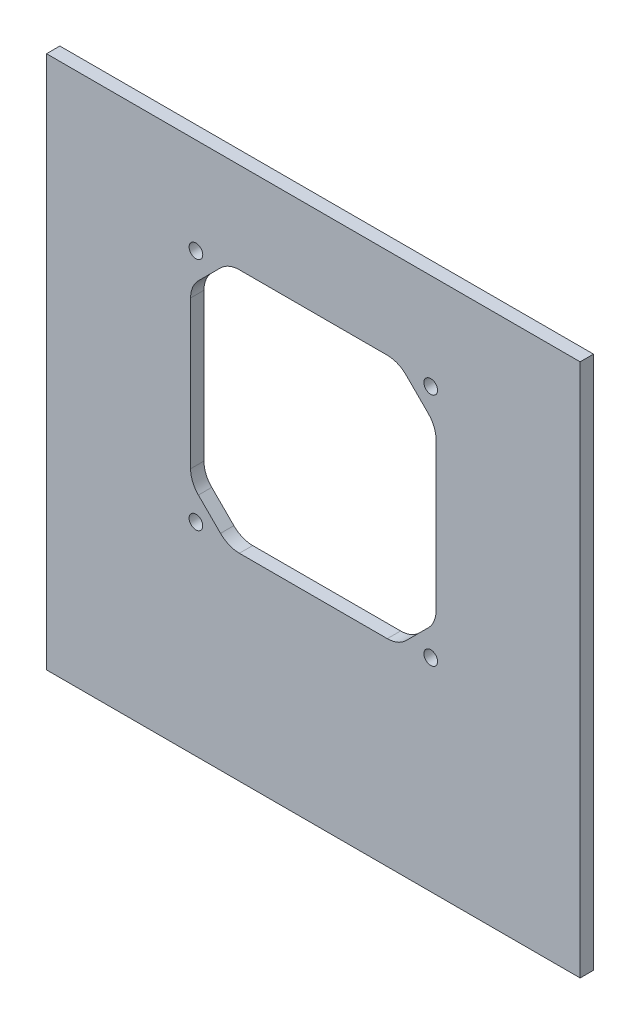
ISO-10303-21;
HEADER;
FILE_DESCRIPTION(('STEP AP214'),'2;1');
FILE_NAME('part.step','',(''),(''),'','','');
FILE_SCHEMA(('AUTOMOTIVE_DESIGN { 1 0 10303 214 1 1 1 1 }'));
ENDSEC;
DATA;
#1=APPLICATION_CONTEXT('core data for automotive mechanical design processes');
#2=APPLICATION_PROTOCOL_DEFINITION('international standard','automotive_design',2000,#1);
#3=PRODUCT_CONTEXT('',#1,'mechanical');
#4=PRODUCT('Part','Part','',(#3));
#5=PRODUCT_RELATED_PRODUCT_CATEGORY('part','',(#4));
#6=PRODUCT_DEFINITION_FORMATION('','',#4);
#7=PRODUCT_DEFINITION_CONTEXT('part definition',#1,'design');
#8=PRODUCT_DEFINITION('design','',#6,#7);
#9=PRODUCT_DEFINITION_SHAPE('','',#8);
#10=(LENGTH_UNIT() NAMED_UNIT(*) SI_UNIT(.MILLI.,.METRE.));
#11=(NAMED_UNIT(*) PLANE_ANGLE_UNIT() SI_UNIT($,.RADIAN.));
#12=(NAMED_UNIT(*) SI_UNIT($,.STERADIAN.) SOLID_ANGLE_UNIT());
#13=UNCERTAINTY_MEASURE_WITH_UNIT(LENGTH_MEASURE(1.E-05),#10,'distance_accuracy_value','');
#14=(GEOMETRIC_REPRESENTATION_CONTEXT(3) GLOBAL_UNCERTAINTY_ASSIGNED_CONTEXT((#13)) GLOBAL_UNIT_ASSIGNED_CONTEXT((#10,
#11,#12)) REPRESENTATION_CONTEXT('',''));
#15=CARTESIAN_POINT('',(0.,0.,0.));
#16=DIRECTION('',(0.,0.,1.));
#17=DIRECTION('',(1.,0.,0.));
#18=AXIS2_PLACEMENT_3D('',#15,#16,#17);
#19=CARTESIAN_POINT('',(0.,0.,6.35));
#20=DIRECTION('',(1.,0.,0.));
#21=DIRECTION('',(0.,0.,-1.));
#22=AXIS2_PLACEMENT_3D('',#19,#20,#21);
#23=PLANE('',#22);
#24=DIRECTION('',(0.,-1.,0.));
#25=VECTOR('',#24,1.);
#26=CARTESIAN_POINT('',(0.,0.,0.));
#27=LINE('',#26,#25);
#28=CARTESIAN_POINT('',(0.,254.,0.));
#29=VERTEX_POINT('',#28);
#30=CARTESIAN_POINT('',(0.,0.,0.));
#31=VERTEX_POINT('',#30);
#32=EDGE_CURVE('E278',#29,#31,#27,.T.);
#33=ORIENTED_EDGE('',*,*,#32,.T.);
#34=DIRECTION('',(0.,0.,-1.));
#35=VECTOR('',#34,1.);
#36=CARTESIAN_POINT('',(0.,0.,6.35));
#37=LINE('',#36,#35);
#38=CARTESIAN_POINT('',(0.,0.,6.35));
#39=VERTEX_POINT('',#38);
#40=EDGE_CURVE('E11',#39,#31,#37,.T.);
#41=ORIENTED_EDGE('',*,*,#40,.F.);
#42=DIRECTION('',(0.,-1.,0.));
#43=VECTOR('',#42,1.);
#44=CARTESIAN_POINT('',(0.,0.,6.35));
#45=LINE('',#44,#43);
#46=CARTESIAN_POINT('',(0.,254.,6.35));
#47=VERTEX_POINT('',#46);
#48=EDGE_CURVE('E306',#47,#39,#45,.T.);
#49=ORIENTED_EDGE('',*,*,#48,.F.);
#50=DIRECTION('',(0.,0.,-1.));
#51=VECTOR('',#50,1.);
#52=CARTESIAN_POINT('',(0.,254.,6.35));
#53=LINE('',#52,#51);
#54=EDGE_CURVE('E316',#47,#29,#53,.T.);
#55=ORIENTED_EDGE('',*,*,#54,.T.);
#56=EDGE_LOOP('',(#33,#41,#49,#55));
#57=FACE_BOUND('',#56,.T.);
#58=ADVANCED_FACE('F33',(#57),#23,.F.);
#59=CARTESIAN_POINT('',(0.,0.,6.35));
#60=DIRECTION('',(0.,1.,0.));
#61=DIRECTION('',(0.,0.,1.));
#62=AXIS2_PLACEMENT_3D('',#59,#60,#61);
#63=PLANE('',#62);
#64=DIRECTION('',(1.,0.,0.));
#65=VECTOR('',#64,1.);
#66=CARTESIAN_POINT('',(0.,0.,0.));
#67=LINE('',#66,#65);
#68=CARTESIAN_POINT('',(254.,0.,0.));
#69=VERTEX_POINT('',#68);
#70=EDGE_CURVE('E319',#31,#69,#67,.T.);
#71=ORIENTED_EDGE('',*,*,#70,.T.);
#72=DIRECTION('',(0.,0.,-1.));
#73=VECTOR('',#72,1.);
#74=CARTESIAN_POINT('',(254.,0.,6.35));
#75=LINE('',#74,#73);
#76=CARTESIAN_POINT('',(254.,0.,6.35));
#77=VERTEX_POINT('',#76);
#78=EDGE_CURVE('E40',#77,#69,#75,.T.);
#79=ORIENTED_EDGE('',*,*,#78,.F.);
#80=DIRECTION('',(1.,0.,0.));
#81=VECTOR('',#80,1.);
#82=CARTESIAN_POINT('',(0.,0.,6.35));
#83=LINE('',#82,#81);
#84=EDGE_CURVE('E309',#39,#77,#83,.T.);
#85=ORIENTED_EDGE('',*,*,#84,.F.);
#86=ORIENTED_EDGE('',*,*,#40,.T.);
#87=EDGE_LOOP('',(#71,#79,#85,#86));
#88=FACE_BOUND('',#87,.T.);
#89=ADVANCED_FACE('F347',(#88),#63,.F.);
#90=CARTESIAN_POINT('',(254.,0.,6.35));
#91=DIRECTION('',(-1.,0.,0.));
#92=DIRECTION('',(0.,0.,1.));
#93=AXIS2_PLACEMENT_3D('',#90,#91,#92);
#94=PLANE('',#93);
#95=DIRECTION('',(0.,1.,0.));
#96=VECTOR('',#95,1.);
#97=CARTESIAN_POINT('',(254.,0.,0.));
#98=LINE('',#97,#96);
#99=CARTESIAN_POINT('',(254.,254.,0.));
#100=VERTEX_POINT('',#99);
#101=EDGE_CURVE('E321',#69,#100,#98,.T.);
#102=ORIENTED_EDGE('',*,*,#101,.T.);
#103=DIRECTION('',(0.,0.,-1.));
#104=VECTOR('',#103,1.);
#105=CARTESIAN_POINT('',(254.,254.,6.35));
#106=LINE('',#105,#104);
#107=CARTESIAN_POINT('',(254.,254.,6.35));
#108=VERTEX_POINT('',#107);
#109=EDGE_CURVE('E326',#108,#100,#106,.T.);
#110=ORIENTED_EDGE('',*,*,#109,.F.);
#111=DIRECTION('',(0.,1.,0.));
#112=VECTOR('',#111,1.);
#113=CARTESIAN_POINT('',(254.,0.,6.35));
#114=LINE('',#113,#112);
#115=EDGE_CURVE('E312',#77,#108,#114,.T.);
#116=ORIENTED_EDGE('',*,*,#115,.F.);
#117=ORIENTED_EDGE('',*,*,#78,.T.);
#118=EDGE_LOOP('',(#102,#110,#116,#117));
#119=FACE_BOUND('',#118,.T.);
#120=ADVANCED_FACE('F333',(#119),#94,.F.);
#121=CARTESIAN_POINT('',(0.,254.,6.35));
#122=DIRECTION('',(0.,-1.,0.));
#123=DIRECTION('',(0.,0.,-1.));
#124=AXIS2_PLACEMENT_3D('',#121,#122,#123);
#125=PLANE('',#124);
#126=DIRECTION('',(-1.,0.,0.));
#127=VECTOR('',#126,1.);
#128=CARTESIAN_POINT('',(0.,254.,0.));
#129=LINE('',#128,#127);
#130=EDGE_CURVE('E310',#100,#29,#129,.T.);
#131=ORIENTED_EDGE('',*,*,#130,.T.);
#132=ORIENTED_EDGE('',*,*,#54,.F.);
#133=DIRECTION('',(-1.,0.,0.));
#134=VECTOR('',#133,1.);
#135=CARTESIAN_POINT('',(0.,254.,6.35));
#136=LINE('',#135,#134);
#137=EDGE_CURVE('E314',#108,#47,#136,.T.);
#138=ORIENTED_EDGE('',*,*,#137,.F.);
#139=ORIENTED_EDGE('',*,*,#109,.T.);
#140=EDGE_LOOP('',(#131,#132,#138,#139));
#141=FACE_BOUND('',#140,.T.);
#142=ADVANCED_FACE('F340',(#141),#125,.F.);
#143=CARTESIAN_POINT('',(0.,0.,6.35));
#144=DIRECTION('',(0.,0.,-1.));
#145=DIRECTION('',(-1.,0.,0.));
#146=AXIS2_PLACEMENT_3D('',#143,#144,#145);
#147=PLANE('',#146);
#148=CARTESIAN_POINT('',(71.12,96.52,6.35));
#149=DIRECTION('',(0.,0.,1.));
#150=DIRECTION('',(1.,0.,0.));
#151=AXIS2_PLACEMENT_3D('',#148,#149,#150);
#152=CIRCLE('',#151,3.25000000000001);
#153=CARTESIAN_POINT('',(74.37,96.52,6.35));
#154=VERTEX_POINT('',#153);
#155=EDGE_CURVE('E194',#154,#154,#152,.T.);
#156=ORIENTED_EDGE('',*,*,#155,.F.);
#157=EDGE_LOOP('',(#156));
#158=FACE_BOUND('',#157,.T.);
#159=CARTESIAN_POINT('',(182.88,96.52,6.35));
#160=DIRECTION('',(0.,0.,1.));
#161=DIRECTION('',(1.,0.,0.));
#162=AXIS2_PLACEMENT_3D('',#159,#160,#161);
#163=CIRCLE('',#162,3.25000000000001);
#164=CARTESIAN_POINT('',(186.13,96.52,6.35));
#165=VERTEX_POINT('',#164);
#166=EDGE_CURVE('E458',#165,#165,#163,.T.);
#167=ORIENTED_EDGE('',*,*,#166,.F.);
#168=EDGE_LOOP('',(#167));
#169=FACE_BOUND('',#168,.T.);
#170=CARTESIAN_POINT('',(182.88,208.28,6.35));
#171=DIRECTION('',(0.,0.,1.));
#172=DIRECTION('',(1.,0.,0.));
#173=AXIS2_PLACEMENT_3D('',#170,#171,#172);
#174=CIRCLE('',#173,3.25000000000001);
#175=CARTESIAN_POINT('',(186.13,208.28,6.35));
#176=VERTEX_POINT('',#175);
#177=EDGE_CURVE('E450',#176,#176,#174,.T.);
#178=ORIENTED_EDGE('',*,*,#177,.F.);
#179=EDGE_LOOP('',(#178));
#180=FACE_BOUND('',#179,.T.);
#181=CARTESIAN_POINT('',(71.12,208.28,6.35));
#182=DIRECTION('',(0.,0.,1.));
#183=DIRECTION('',(1.,0.,0.));
#184=AXIS2_PLACEMENT_3D('',#181,#182,#183);
#185=CIRCLE('',#184,3.25000000000001);
#186=CARTESIAN_POINT('',(74.37,208.28,6.35));
#187=VERTEX_POINT('',#186);
#188=EDGE_CURVE('E444',#187,#187,#185,.T.);
#189=ORIENTED_EDGE('',*,*,#188,.F.);
#190=EDGE_LOOP('',(#189));
#191=FACE_BOUND('',#190,.T.);
#192=DIRECTION('',(-1.,0.,0.));
#193=VECTOR('',#192,1.);
#194=CARTESIAN_POINT('',(91.8010244842766,210.82,6.35));
#195=LINE('',#194,#193);
#196=CARTESIAN_POINT('',(162.198975515723,210.82,6.35));
#197=VERTEX_POINT('',#196);
#198=CARTESIAN_POINT('',(91.8010244842766,210.82,6.35));
#199=VERTEX_POINT('',#198);
#200=EDGE_CURVE('E235',#197,#199,#195,.T.);
#201=ORIENTED_EDGE('',*,*,#200,.F.);
#202=CARTESIAN_POINT('',(162.198975515723,198.12,6.35));
#203=DIRECTION('',(0.,0.,1.));
#204=DIRECTION('',(1.,0.,0.));
#205=AXIS2_PLACEMENT_3D('',#202,#203,#204);
#206=CIRCLE('',#205,12.7);
#207=CARTESIAN_POINT('',(171.179231636793,207.100256121069,6.35));
#208=VERTEX_POINT('',#207);
#209=EDGE_CURVE('E47',#208,#197,#206,.T.);
#210=ORIENTED_EDGE('',*,*,#209,.F.);
#211=DIRECTION('',(-0.707106781186549,0.707106781186546,0.));
#212=VECTOR('',#211,1.);
#213=CARTESIAN_POINT('',(171.179231636793,207.100256121069,6.35));
#214=LINE('',#213,#212);
#215=CARTESIAN_POINT('',(181.700256121069,196.579231636793,6.35));
#216=VERTEX_POINT('',#215);
#217=EDGE_CURVE('E188',#216,#208,#214,.T.);
#218=ORIENTED_EDGE('',*,*,#217,.F.);
#219=CARTESIAN_POINT('',(172.72,187.598975515723,6.35));
#220=DIRECTION('',(0.,0.,1.));
#221=DIRECTION('',(-1.,0.,0.));
#222=AXIS2_PLACEMENT_3D('',#219,#220,#221);
#223=CIRCLE('',#222,12.7);
#224=CARTESIAN_POINT('',(185.42,187.598975515723,6.35));
#225=VERTEX_POINT('',#224);
#226=EDGE_CURVE('E191',#225,#216,#223,.T.);
#227=ORIENTED_EDGE('',*,*,#226,.F.);
#228=DIRECTION('',(0.,1.,0.));
#229=VECTOR('',#228,1.);
#230=CARTESIAN_POINT('',(185.42,187.598975515723,6.35));
#231=LINE('',#230,#229);
#232=CARTESIAN_POINT('',(185.42,117.201024484277,6.35));
#233=VERTEX_POINT('',#232);
#234=EDGE_CURVE('E271',#233,#225,#231,.T.);
#235=ORIENTED_EDGE('',*,*,#234,.F.);
#236=CARTESIAN_POINT('',(172.72,117.201024484277,6.35));
#237=DIRECTION('',(0.,0.,1.));
#238=DIRECTION('',(1.,0.,0.));
#239=AXIS2_PLACEMENT_3D('',#236,#237,#238);
#240=CIRCLE('',#239,12.7);
#241=CARTESIAN_POINT('',(181.700256121069,108.220768363207,6.35));
#242=VERTEX_POINT('',#241);
#243=EDGE_CURVE('E268',#242,#233,#240,.T.);
#244=ORIENTED_EDGE('',*,*,#243,.F.);
#245=DIRECTION('',(0.707106781186551,0.707106781186544,0.));
#246=VECTOR('',#245,1.);
#247=CARTESIAN_POINT('',(181.700256121069,108.220768363207,6.35));
#248=LINE('',#247,#246);
#249=CARTESIAN_POINT('',(171.179231636792,97.6997438789308,6.35));
#250=VERTEX_POINT('',#249);
#251=EDGE_CURVE('E265',#250,#242,#248,.T.);
#252=ORIENTED_EDGE('',*,*,#251,.F.);
#253=CARTESIAN_POINT('',(162.198975515723,106.68,6.35));
#254=DIRECTION('',(0.,0.,1.));
#255=DIRECTION('',(-1.,0.,0.));
#256=AXIS2_PLACEMENT_3D('',#253,#254,#255);
#257=CIRCLE('',#256,12.7);
#258=CARTESIAN_POINT('',(162.198975515723,93.98,6.35));
#259=VERTEX_POINT('',#258);
#260=EDGE_CURVE('E262',#259,#250,#257,.T.);
#261=ORIENTED_EDGE('',*,*,#260,.F.);
#262=DIRECTION('',(1.,0.,0.));
#263=VECTOR('',#262,1.);
#264=CARTESIAN_POINT('',(91.8010244842766,93.98,6.35));
#265=LINE('',#264,#263);
#266=CARTESIAN_POINT('',(91.8010244842766,93.98,6.35));
#267=VERTEX_POINT('',#266);
#268=EDGE_CURVE('E259',#267,#259,#265,.T.);
#269=ORIENTED_EDGE('',*,*,#268,.F.);
#270=CARTESIAN_POINT('',(91.8010244842766,106.68,6.35));
#271=DIRECTION('',(0.,0.,1.));
#272=DIRECTION('',(1.,0.,0.));
#273=AXIS2_PLACEMENT_3D('',#270,#271,#272);
#274=CIRCLE('',#273,12.7);
#275=CARTESIAN_POINT('',(82.8207683632074,97.6997438789309,6.35));
#276=VERTEX_POINT('',#275);
#277=EDGE_CURVE('E256',#276,#267,#274,.T.);
#278=ORIENTED_EDGE('',*,*,#277,.F.);
#279=DIRECTION('',(0.707106781186546,-0.707106781186549,0.));
#280=VECTOR('',#279,1.);
#281=CARTESIAN_POINT('',(72.2997438789309,108.220768363207,6.35));
#282=LINE('',#281,#280);
#283=CARTESIAN_POINT('',(72.2997438789309,108.220768363207,6.35));
#284=VERTEX_POINT('',#283);
#285=EDGE_CURVE('E253',#284,#276,#282,.T.);
#286=ORIENTED_EDGE('',*,*,#285,.F.);
#287=CARTESIAN_POINT('',(81.28,117.201024484277,6.35));
#288=DIRECTION('',(0.,0.,1.));
#289=DIRECTION('',(-1.,0.,0.));
#290=AXIS2_PLACEMENT_3D('',#287,#288,#289);
#291=CIRCLE('',#290,12.7);
#292=CARTESIAN_POINT('',(68.58,117.201024484277,6.35));
#293=VERTEX_POINT('',#292);
#294=EDGE_CURVE('E250',#293,#284,#291,.T.);
#295=ORIENTED_EDGE('',*,*,#294,.F.);
#296=DIRECTION('',(0.,-1.,0.));
#297=VECTOR('',#296,1.);
#298=CARTESIAN_POINT('',(68.58,187.598975515723,6.35));
#299=LINE('',#298,#297);
#300=CARTESIAN_POINT('',(68.58,187.598975515723,6.35));
#301=VERTEX_POINT('',#300);
#302=EDGE_CURVE('E247',#301,#293,#299,.T.);
#303=ORIENTED_EDGE('',*,*,#302,.F.);
#304=CARTESIAN_POINT('',(81.28,187.598975515723,6.35));
#305=DIRECTION('',(0.,0.,1.));
#306=DIRECTION('',(1.,0.,0.));
#307=AXIS2_PLACEMENT_3D('',#304,#305,#306);
#308=CIRCLE('',#307,12.7);
#309=CARTESIAN_POINT('',(72.2997438789308,196.579231636793,6.35));
#310=VERTEX_POINT('',#309);
#311=EDGE_CURVE('E244',#310,#301,#308,.T.);
#312=ORIENTED_EDGE('',*,*,#311,.F.);
#313=DIRECTION('',(-0.707106781186544,-0.707106781186551,0.));
#314=VECTOR('',#313,1.);
#315=CARTESIAN_POINT('',(72.2997438789309,196.579231636792,6.35));
#316=LINE('',#315,#314);
#317=CARTESIAN_POINT('',(82.8207683632074,207.100256121069,6.35));
#318=VERTEX_POINT('',#317);
#319=EDGE_CURVE('E241',#318,#310,#316,.T.);
#320=ORIENTED_EDGE('',*,*,#319,.F.);
#321=CARTESIAN_POINT('',(91.8010244842766,198.12,6.35));
#322=DIRECTION('',(0.,0.,1.));
#323=DIRECTION('',(-1.,0.,0.));
#324=AXIS2_PLACEMENT_3D('',#321,#322,#323);
#325=CIRCLE('',#324,12.7);
#326=EDGE_CURVE('E238',#199,#318,#325,.T.);
#327=ORIENTED_EDGE('',*,*,#326,.F.);
#328=EDGE_LOOP('',(#201,#210,#218,#227,#235,#244,#252,#261,#269,#278,#286,#295,#303,#312,#320,#327));
#329=FACE_BOUND('',#328,.T.);
#330=ORIENTED_EDGE('',*,*,#48,.T.);
#331=ORIENTED_EDGE('',*,*,#84,.T.);
#332=ORIENTED_EDGE('',*,*,#115,.T.);
#333=ORIENTED_EDGE('',*,*,#137,.T.);
#334=EDGE_LOOP('',(#330,#331,#332,#333));
#335=FACE_BOUND('',#334,.T.);
#336=ADVANCED_FACE('F346',(#158,#169,#180,#191,#329,#335),#147,.F.);
#337=CARTESIAN_POINT('',(0.,0.,0.));
#338=DIRECTION('',(0.,0.,-1.));
#339=DIRECTION('',(-1.,0.,0.));
#340=AXIS2_PLACEMENT_3D('',#337,#338,#339);
#341=PLANE('',#340);
#342=CARTESIAN_POINT('',(71.12,96.52,0.));
#343=DIRECTION('',(0.,0.,1.));
#344=DIRECTION('',(1.,0.,0.));
#345=AXIS2_PLACEMENT_3D('',#342,#343,#344);
#346=CIRCLE('',#345,3.25000000000001);
#347=CARTESIAN_POINT('',(74.37,96.52,0.));
#348=VERTEX_POINT('',#347);
#349=EDGE_CURVE('E460',#348,#348,#346,.T.);
#350=ORIENTED_EDGE('',*,*,#349,.T.);
#351=EDGE_LOOP('',(#350));
#352=FACE_BOUND('',#351,.T.);
#353=CARTESIAN_POINT('',(182.88,96.52,0.));
#354=DIRECTION('',(0.,0.,1.));
#355=DIRECTION('',(1.,0.,0.));
#356=AXIS2_PLACEMENT_3D('',#353,#354,#355);
#357=CIRCLE('',#356,3.25000000000001);
#358=CARTESIAN_POINT('',(186.13,96.52,0.));
#359=VERTEX_POINT('',#358);
#360=EDGE_CURVE('E455',#359,#359,#357,.T.);
#361=ORIENTED_EDGE('',*,*,#360,.T.);
#362=EDGE_LOOP('',(#361));
#363=FACE_BOUND('',#362,.T.);
#364=CARTESIAN_POINT('',(182.88,208.28,0.));
#365=DIRECTION('',(0.,0.,1.));
#366=DIRECTION('',(1.,0.,0.));
#367=AXIS2_PLACEMENT_3D('',#364,#365,#366);
#368=CIRCLE('',#367,3.25000000000001);
#369=CARTESIAN_POINT('',(186.13,208.28,0.));
#370=VERTEX_POINT('',#369);
#371=EDGE_CURVE('E446',#370,#370,#368,.T.);
#372=ORIENTED_EDGE('',*,*,#371,.T.);
#373=EDGE_LOOP('',(#372));
#374=FACE_BOUND('',#373,.T.);
#375=CARTESIAN_POINT('',(71.12,208.28,0.));
#376=DIRECTION('',(0.,0.,1.));
#377=DIRECTION('',(1.,0.,0.));
#378=AXIS2_PLACEMENT_3D('',#375,#376,#377);
#379=CIRCLE('',#378,3.25000000000001);
#380=CARTESIAN_POINT('',(74.37,208.28,0.));
#381=VERTEX_POINT('',#380);
#382=EDGE_CURVE('E236',#381,#381,#379,.T.);
#383=ORIENTED_EDGE('',*,*,#382,.T.);
#384=EDGE_LOOP('',(#383));
#385=FACE_BOUND('',#384,.T.);
#386=CARTESIAN_POINT('',(162.198975515723,198.12,0.));
#387=DIRECTION('',(0.,0.,1.));
#388=DIRECTION('',(1.,0.,0.));
#389=AXIS2_PLACEMENT_3D('',#386,#387,#388);
#390=CIRCLE('',#389,12.7);
#391=CARTESIAN_POINT('',(171.179231636793,207.100256121069,0.));
#392=VERTEX_POINT('',#391);
#393=CARTESIAN_POINT('',(162.198975515723,210.82,0.));
#394=VERTEX_POINT('',#393);
#395=EDGE_CURVE('E171',#392,#394,#390,.T.);
#396=ORIENTED_EDGE('',*,*,#395,.T.);
#397=DIRECTION('',(-1.,0.,0.));
#398=VECTOR('',#397,1.);
#399=CARTESIAN_POINT('',(91.8010244842766,210.82,0.));
#400=LINE('',#399,#398);
#401=CARTESIAN_POINT('',(91.8010244842766,210.82,0.));
#402=VERTEX_POINT('',#401);
#403=EDGE_CURVE('E180',#394,#402,#400,.T.);
#404=ORIENTED_EDGE('',*,*,#403,.T.);
#405=CARTESIAN_POINT('',(91.8010244842766,198.12,0.));
#406=DIRECTION('',(0.,0.,1.));
#407=DIRECTION('',(-1.,0.,0.));
#408=AXIS2_PLACEMENT_3D('',#405,#406,#407);
#409=CIRCLE('',#408,12.7);
#410=CARTESIAN_POINT('',(82.8207683632074,207.100256121069,0.));
#411=VERTEX_POINT('',#410);
#412=EDGE_CURVE('E55',#402,#411,#409,.T.);
#413=ORIENTED_EDGE('',*,*,#412,.T.);
#414=DIRECTION('',(-0.707106781186544,-0.707106781186551,0.));
#415=VECTOR('',#414,1.);
#416=CARTESIAN_POINT('',(72.2997438789309,196.579231636792,0.));
#417=LINE('',#416,#415);
#418=CARTESIAN_POINT('',(72.2997438789308,196.579231636793,0.));
#419=VERTEX_POINT('',#418);
#420=EDGE_CURVE('E198',#411,#419,#417,.T.);
#421=ORIENTED_EDGE('',*,*,#420,.T.);
#422=CARTESIAN_POINT('',(81.28,187.598975515723,0.));
#423=DIRECTION('',(0.,0.,1.));
#424=DIRECTION('',(1.,0.,0.));
#425=AXIS2_PLACEMENT_3D('',#422,#423,#424);
#426=CIRCLE('',#425,12.7);
#427=CARTESIAN_POINT('',(68.58,187.598975515723,0.));
#428=VERTEX_POINT('',#427);
#429=EDGE_CURVE('E201',#419,#428,#426,.T.);
#430=ORIENTED_EDGE('',*,*,#429,.T.);
#431=DIRECTION('',(0.,-1.,0.));
#432=VECTOR('',#431,1.);
#433=CARTESIAN_POINT('',(68.58,187.598975515723,0.));
#434=LINE('',#433,#432);
#435=CARTESIAN_POINT('',(68.58,117.201024484277,0.));
#436=VERTEX_POINT('',#435);
#437=EDGE_CURVE('E204',#428,#436,#434,.T.);
#438=ORIENTED_EDGE('',*,*,#437,.T.);
#439=CARTESIAN_POINT('',(81.28,117.201024484277,0.));
#440=DIRECTION('',(0.,0.,1.));
#441=DIRECTION('',(-1.,0.,0.));
#442=AXIS2_PLACEMENT_3D('',#439,#440,#441);
#443=CIRCLE('',#442,12.7);
#444=CARTESIAN_POINT('',(72.2997438789309,108.220768363207,0.));
#445=VERTEX_POINT('',#444);
#446=EDGE_CURVE('E207',#436,#445,#443,.T.);
#447=ORIENTED_EDGE('',*,*,#446,.T.);
#448=DIRECTION('',(0.707106781186546,-0.707106781186549,0.));
#449=VECTOR('',#448,1.);
#450=CARTESIAN_POINT('',(72.2997438789309,108.220768363207,0.));
#451=LINE('',#450,#449);
#452=CARTESIAN_POINT('',(82.8207683632074,97.6997438789309,0.));
#453=VERTEX_POINT('',#452);
#454=EDGE_CURVE('E210',#445,#453,#451,.T.);
#455=ORIENTED_EDGE('',*,*,#454,.T.);
#456=CARTESIAN_POINT('',(91.8010244842766,106.68,0.));
#457=DIRECTION('',(0.,0.,1.));
#458=DIRECTION('',(1.,0.,0.));
#459=AXIS2_PLACEMENT_3D('',#456,#457,#458);
#460=CIRCLE('',#459,12.7);
#461=CARTESIAN_POINT('',(91.8010244842766,93.98,0.));
#462=VERTEX_POINT('',#461);
#463=EDGE_CURVE('E213',#453,#462,#460,.T.);
#464=ORIENTED_EDGE('',*,*,#463,.T.);
#465=DIRECTION('',(1.,0.,0.));
#466=VECTOR('',#465,1.);
#467=CARTESIAN_POINT('',(91.8010244842766,93.98,0.));
#468=LINE('',#467,#466);
#469=CARTESIAN_POINT('',(162.198975515723,93.98,0.));
#470=VERTEX_POINT('',#469);
#471=EDGE_CURVE('E216',#462,#470,#468,.T.);
#472=ORIENTED_EDGE('',*,*,#471,.T.);
#473=CARTESIAN_POINT('',(162.198975515723,106.68,0.));
#474=DIRECTION('',(0.,0.,1.));
#475=DIRECTION('',(-1.,0.,0.));
#476=AXIS2_PLACEMENT_3D('',#473,#474,#475);
#477=CIRCLE('',#476,12.7);
#478=CARTESIAN_POINT('',(171.179231636792,97.6997438789308,0.));
#479=VERTEX_POINT('',#478);
#480=EDGE_CURVE('E219',#470,#479,#477,.T.);
#481=ORIENTED_EDGE('',*,*,#480,.T.);
#482=DIRECTION('',(0.707106781186551,0.707106781186544,0.));
#483=VECTOR('',#482,1.);
#484=CARTESIAN_POINT('',(181.700256121069,108.220768363207,0.));
#485=LINE('',#484,#483);
#486=CARTESIAN_POINT('',(181.700256121069,108.220768363207,0.));
#487=VERTEX_POINT('',#486);
#488=EDGE_CURVE('E222',#479,#487,#485,.T.);
#489=ORIENTED_EDGE('',*,*,#488,.T.);
#490=CARTESIAN_POINT('',(172.72,117.201024484277,0.));
#491=DIRECTION('',(0.,0.,1.));
#492=DIRECTION('',(1.,0.,0.));
#493=AXIS2_PLACEMENT_3D('',#490,#491,#492);
#494=CIRCLE('',#493,12.7);
#495=CARTESIAN_POINT('',(185.42,117.201024484277,0.));
#496=VERTEX_POINT('',#495);
#497=EDGE_CURVE('E225',#487,#496,#494,.T.);
#498=ORIENTED_EDGE('',*,*,#497,.T.);
#499=DIRECTION('',(0.,1.,0.));
#500=VECTOR('',#499,1.);
#501=CARTESIAN_POINT('',(185.42,187.598975515723,0.));
#502=LINE('',#501,#500);
#503=CARTESIAN_POINT('',(185.42,187.598975515723,0.));
#504=VERTEX_POINT('',#503);
#505=EDGE_CURVE('E228',#496,#504,#502,.T.);
#506=ORIENTED_EDGE('',*,*,#505,.T.);
#507=CARTESIAN_POINT('',(172.72,187.598975515723,0.));
#508=DIRECTION('',(0.,0.,1.));
#509=DIRECTION('',(-1.,0.,0.));
#510=AXIS2_PLACEMENT_3D('',#507,#508,#509);
#511=CIRCLE('',#510,12.7);
#512=CARTESIAN_POINT('',(181.700256121069,196.579231636793,0.));
#513=VERTEX_POINT('',#512);
#514=EDGE_CURVE('E231',#504,#513,#511,.T.);
#515=ORIENTED_EDGE('',*,*,#514,.T.);
#516=DIRECTION('',(-0.707106781186549,0.707106781186546,0.));
#517=VECTOR('',#516,1.);
#518=CARTESIAN_POINT('',(171.179231636793,207.100256121069,0.));
#519=LINE('',#518,#517);
#520=EDGE_CURVE('E177',#513,#392,#519,.T.);
#521=ORIENTED_EDGE('',*,*,#520,.T.);
#522=EDGE_LOOP('',(#396,#404,#413,#421,#430,#438,#447,#455,#464,#472,#481,#489,#498,#506,#515,#521));
#523=FACE_BOUND('',#522,.T.);
#524=ORIENTED_EDGE('',*,*,#32,.F.);
#525=ORIENTED_EDGE('',*,*,#130,.F.);
#526=ORIENTED_EDGE('',*,*,#101,.F.);
#527=ORIENTED_EDGE('',*,*,#70,.F.);
#528=EDGE_LOOP('',(#524,#525,#526,#527));
#529=FACE_BOUND('',#528,.T.);
#530=ADVANCED_FACE('F184',(#352,#363,#374,#385,#523,#529),#341,.T.);
#531=CARTESIAN_POINT('',(162.198975515723,198.12,0.));
#532=DIRECTION('',(0.,0.,1.));
#533=DIRECTION('',(1.,0.,0.));
#534=AXIS2_PLACEMENT_3D('',#531,#532,#533);
#535=CYLINDRICAL_SURFACE('',#534,12.7);
#536=ORIENTED_EDGE('',*,*,#209,.T.);
#537=DIRECTION('',(0.,0.,1.));
#538=VECTOR('',#537,1.);
#539=CARTESIAN_POINT('',(162.198975515723,210.82,0.));
#540=LINE('',#539,#538);
#541=EDGE_CURVE('E167',#394,#197,#540,.T.);
#542=ORIENTED_EDGE('',*,*,#541,.F.);
#543=ORIENTED_EDGE('',*,*,#395,.F.);
#544=DIRECTION('',(0.,0.,1.));
#545=VECTOR('',#544,1.);
#546=CARTESIAN_POINT('',(171.179231636793,207.100256121069,0.));
#547=LINE('',#546,#545);
#548=EDGE_CURVE('E276',#392,#208,#547,.T.);
#549=ORIENTED_EDGE('',*,*,#548,.T.);
#550=EDGE_LOOP('',(#536,#542,#543,#549));
#551=FACE_BOUND('',#550,.T.);
#552=ADVANCED_FACE('F169',(#551),#535,.F.);
#553=CARTESIAN_POINT('',(171.179231636793,207.100256121069,0.));
#554=DIRECTION('',(0.707106781186546,0.707106781186549,0.));
#555=DIRECTION('',(-0.707106781186549,0.707106781186546,0.));
#556=AXIS2_PLACEMENT_3D('',#553,#554,#555);
#557=PLANE('',#556);
#558=ORIENTED_EDGE('',*,*,#217,.T.);
#559=ORIENTED_EDGE('',*,*,#548,.F.);
#560=ORIENTED_EDGE('',*,*,#520,.F.);
#561=DIRECTION('',(0.,0.,1.));
#562=VECTOR('',#561,1.);
#563=CARTESIAN_POINT('',(181.700256121069,196.579231636793,0.));
#564=LINE('',#563,#562);
#565=EDGE_CURVE('E279',#513,#216,#564,.T.);
#566=ORIENTED_EDGE('',*,*,#565,.T.);
#567=EDGE_LOOP('',(#558,#559,#560,#566));
#568=FACE_BOUND('',#567,.T.);
#569=ADVANCED_FACE('F365',(#568),#557,.F.);
#570=CARTESIAN_POINT('',(172.72,187.598975515723,0.));
#571=DIRECTION('',(0.,0.,1.));
#572=DIRECTION('',(1.,0.,0.));
#573=AXIS2_PLACEMENT_3D('',#570,#571,#572);
#574=CYLINDRICAL_SURFACE('',#573,12.7);
#575=ORIENTED_EDGE('',*,*,#226,.T.);
#576=ORIENTED_EDGE('',*,*,#565,.F.);
#577=ORIENTED_EDGE('',*,*,#514,.F.);
#578=DIRECTION('',(0.,0.,1.));
#579=VECTOR('',#578,1.);
#580=CARTESIAN_POINT('',(185.42,187.598975515723,0.));
#581=LINE('',#580,#579);
#582=EDGE_CURVE('E281',#504,#225,#581,.T.);
#583=ORIENTED_EDGE('',*,*,#582,.T.);
#584=EDGE_LOOP('',(#575,#576,#577,#583));
#585=FACE_BOUND('',#584,.T.);
#586=ADVANCED_FACE('F415',(#585),#574,.F.);
#587=CARTESIAN_POINT('',(185.42,187.598975515723,0.));
#588=DIRECTION('',(1.,0.,0.));
#589=DIRECTION('',(0.,1.,0.));
#590=AXIS2_PLACEMENT_3D('',#587,#588,#589);
#591=PLANE('',#590);
#592=ORIENTED_EDGE('',*,*,#234,.T.);
#593=ORIENTED_EDGE('',*,*,#582,.F.);
#594=ORIENTED_EDGE('',*,*,#505,.F.);
#595=DIRECTION('',(0.,0.,1.));
#596=VECTOR('',#595,1.);
#597=CARTESIAN_POINT('',(185.42,117.201024484277,0.));
#598=LINE('',#597,#596);
#599=EDGE_CURVE('E283',#496,#233,#598,.T.);
#600=ORIENTED_EDGE('',*,*,#599,.T.);
#601=EDGE_LOOP('',(#592,#593,#594,#600));
#602=FACE_BOUND('',#601,.T.);
#603=ADVANCED_FACE('F411',(#602),#591,.F.);
#604=CARTESIAN_POINT('',(172.72,117.201024484277,0.));
#605=DIRECTION('',(0.,0.,1.));
#606=DIRECTION('',(1.,0.,0.));
#607=AXIS2_PLACEMENT_3D('',#604,#605,#606);
#608=CYLINDRICAL_SURFACE('',#607,12.7);
#609=ORIENTED_EDGE('',*,*,#243,.T.);
#610=ORIENTED_EDGE('',*,*,#599,.F.);
#611=ORIENTED_EDGE('',*,*,#497,.F.);
#612=DIRECTION('',(0.,0.,1.));
#613=VECTOR('',#612,1.);
#614=CARTESIAN_POINT('',(181.700256121069,108.220768363207,0.));
#615=LINE('',#614,#613);
#616=EDGE_CURVE('E285',#487,#242,#615,.T.);
#617=ORIENTED_EDGE('',*,*,#616,.T.);
#618=EDGE_LOOP('',(#609,#610,#611,#617));
#619=FACE_BOUND('',#618,.T.);
#620=ADVANCED_FACE('F407',(#619),#608,.F.);
#621=CARTESIAN_POINT('',(181.700256121069,108.220768363207,0.));
#622=DIRECTION('',(0.707106781186544,-0.707106781186551,0.));
#623=DIRECTION('',(0.707106781186551,0.707106781186544,0.));
#624=AXIS2_PLACEMENT_3D('',#621,#622,#623);
#625=PLANE('',#624);
#626=ORIENTED_EDGE('',*,*,#251,.T.);
#627=ORIENTED_EDGE('',*,*,#616,.F.);
#628=ORIENTED_EDGE('',*,*,#488,.F.);
#629=DIRECTION('',(0.,0.,1.));
#630=VECTOR('',#629,1.);
#631=CARTESIAN_POINT('',(171.179231636792,97.6997438789308,0.));
#632=LINE('',#631,#630);
#633=EDGE_CURVE('E287',#479,#250,#632,.T.);
#634=ORIENTED_EDGE('',*,*,#633,.T.);
#635=EDGE_LOOP('',(#626,#627,#628,#634));
#636=FACE_BOUND('',#635,.T.);
#637=ADVANCED_FACE('F403',(#636),#625,.F.);
#638=CARTESIAN_POINT('',(162.198975515723,106.68,0.));
#639=DIRECTION('',(0.,0.,1.));
#640=DIRECTION('',(1.,0.,0.));
#641=AXIS2_PLACEMENT_3D('',#638,#639,#640);
#642=CYLINDRICAL_SURFACE('',#641,12.7);
#643=ORIENTED_EDGE('',*,*,#260,.T.);
#644=ORIENTED_EDGE('',*,*,#633,.F.);
#645=ORIENTED_EDGE('',*,*,#480,.F.);
#646=DIRECTION('',(0.,0.,1.));
#647=VECTOR('',#646,1.);
#648=CARTESIAN_POINT('',(162.198975515723,93.98,0.));
#649=LINE('',#648,#647);
#650=EDGE_CURVE('E289',#470,#259,#649,.T.);
#651=ORIENTED_EDGE('',*,*,#650,.T.);
#652=EDGE_LOOP('',(#643,#644,#645,#651));
#653=FACE_BOUND('',#652,.T.);
#654=ADVANCED_FACE('F399',(#653),#642,.F.);
#655=CARTESIAN_POINT('',(91.8010244842766,93.98,0.));
#656=DIRECTION('',(0.,-1.,0.));
#657=DIRECTION('',(0.,0.,-1.));
#658=AXIS2_PLACEMENT_3D('',#655,#656,#657);
#659=PLANE('',#658);
#660=ORIENTED_EDGE('',*,*,#268,.T.);
#661=ORIENTED_EDGE('',*,*,#650,.F.);
#662=ORIENTED_EDGE('',*,*,#471,.F.);
#663=DIRECTION('',(0.,0.,1.));
#664=VECTOR('',#663,1.);
#665=CARTESIAN_POINT('',(91.8010244842766,93.98,0.));
#666=LINE('',#665,#664);
#667=EDGE_CURVE('E291',#462,#267,#666,.T.);
#668=ORIENTED_EDGE('',*,*,#667,.T.);
#669=EDGE_LOOP('',(#660,#661,#662,#668));
#670=FACE_BOUND('',#669,.T.);
#671=ADVANCED_FACE('F395',(#670),#659,.F.);
#672=CARTESIAN_POINT('',(91.8010244842766,106.68,0.));
#673=DIRECTION('',(0.,0.,1.));
#674=DIRECTION('',(1.,0.,0.));
#675=AXIS2_PLACEMENT_3D('',#672,#673,#674);
#676=CYLINDRICAL_SURFACE('',#675,12.7);
#677=ORIENTED_EDGE('',*,*,#277,.T.);
#678=ORIENTED_EDGE('',*,*,#667,.F.);
#679=ORIENTED_EDGE('',*,*,#463,.F.);
#680=DIRECTION('',(0.,0.,1.));
#681=VECTOR('',#680,1.);
#682=CARTESIAN_POINT('',(82.8207683632074,97.6997438789309,0.));
#683=LINE('',#682,#681);
#684=EDGE_CURVE('E293',#453,#276,#683,.T.);
#685=ORIENTED_EDGE('',*,*,#684,.T.);
#686=EDGE_LOOP('',(#677,#678,#679,#685));
#687=FACE_BOUND('',#686,.T.);
#688=ADVANCED_FACE('F391',(#687),#676,.F.);
#689=CARTESIAN_POINT('',(72.2997438789309,108.220768363207,0.));
#690=DIRECTION('',(-0.707106781186549,-0.707106781186546,0.));
#691=DIRECTION('',(0.707106781186546,-0.707106781186549,0.));
#692=AXIS2_PLACEMENT_3D('',#689,#690,#691);
#693=PLANE('',#692);
#694=ORIENTED_EDGE('',*,*,#285,.T.);
#695=ORIENTED_EDGE('',*,*,#684,.F.);
#696=ORIENTED_EDGE('',*,*,#454,.F.);
#697=DIRECTION('',(0.,0.,1.));
#698=VECTOR('',#697,1.);
#699=CARTESIAN_POINT('',(72.2997438789309,108.220768363207,0.));
#700=LINE('',#699,#698);
#701=EDGE_CURVE('E295',#445,#284,#700,.T.);
#702=ORIENTED_EDGE('',*,*,#701,.T.);
#703=EDGE_LOOP('',(#694,#695,#696,#702));
#704=FACE_BOUND('',#703,.T.);
#705=ADVANCED_FACE('F387',(#704),#693,.F.);
#706=CARTESIAN_POINT('',(81.28,117.201024484277,0.));
#707=DIRECTION('',(0.,0.,1.));
#708=DIRECTION('',(1.,0.,0.));
#709=AXIS2_PLACEMENT_3D('',#706,#707,#708);
#710=CYLINDRICAL_SURFACE('',#709,12.7);
#711=ORIENTED_EDGE('',*,*,#294,.T.);
#712=ORIENTED_EDGE('',*,*,#701,.F.);
#713=ORIENTED_EDGE('',*,*,#446,.F.);
#714=DIRECTION('',(0.,0.,1.));
#715=VECTOR('',#714,1.);
#716=CARTESIAN_POINT('',(68.58,117.201024484277,0.));
#717=LINE('',#716,#715);
#718=EDGE_CURVE('E297',#436,#293,#717,.T.);
#719=ORIENTED_EDGE('',*,*,#718,.T.);
#720=EDGE_LOOP('',(#711,#712,#713,#719));
#721=FACE_BOUND('',#720,.T.);
#722=ADVANCED_FACE('F383',(#721),#710,.F.);
#723=CARTESIAN_POINT('',(68.58,187.598975515723,0.));
#724=DIRECTION('',(-1.,0.,0.));
#725=DIRECTION('',(0.,-1.,0.));
#726=AXIS2_PLACEMENT_3D('',#723,#724,#725);
#727=PLANE('',#726);
#728=ORIENTED_EDGE('',*,*,#302,.T.);
#729=ORIENTED_EDGE('',*,*,#718,.F.);
#730=ORIENTED_EDGE('',*,*,#437,.F.);
#731=DIRECTION('',(0.,0.,1.));
#732=VECTOR('',#731,1.);
#733=CARTESIAN_POINT('',(68.58,187.598975515723,0.));
#734=LINE('',#733,#732);
#735=EDGE_CURVE('E299',#428,#301,#734,.T.);
#736=ORIENTED_EDGE('',*,*,#735,.T.);
#737=EDGE_LOOP('',(#728,#729,#730,#736));
#738=FACE_BOUND('',#737,.T.);
#739=ADVANCED_FACE('F379',(#738),#727,.F.);
#740=CARTESIAN_POINT('',(81.28,187.598975515723,0.));
#741=DIRECTION('',(0.,0.,1.));
#742=DIRECTION('',(1.,0.,0.));
#743=AXIS2_PLACEMENT_3D('',#740,#741,#742);
#744=CYLINDRICAL_SURFACE('',#743,12.7);
#745=ORIENTED_EDGE('',*,*,#311,.T.);
#746=ORIENTED_EDGE('',*,*,#735,.F.);
#747=ORIENTED_EDGE('',*,*,#429,.F.);
#748=DIRECTION('',(0.,0.,1.));
#749=VECTOR('',#748,1.);
#750=CARTESIAN_POINT('',(72.2997438789308,196.579231636793,0.));
#751=LINE('',#750,#749);
#752=EDGE_CURVE('E301',#419,#310,#751,.T.);
#753=ORIENTED_EDGE('',*,*,#752,.T.);
#754=EDGE_LOOP('',(#745,#746,#747,#753));
#755=FACE_BOUND('',#754,.T.);
#756=ADVANCED_FACE('F375',(#755),#744,.F.);
#757=CARTESIAN_POINT('',(72.2997438789309,196.579231636792,0.));
#758=DIRECTION('',(-0.707106781186551,0.707106781186544,0.));
#759=DIRECTION('',(-0.707106781186544,-0.707106781186551,0.));
#760=AXIS2_PLACEMENT_3D('',#757,#758,#759);
#761=PLANE('',#760);
#762=ORIENTED_EDGE('',*,*,#319,.T.);
#763=ORIENTED_EDGE('',*,*,#752,.F.);
#764=ORIENTED_EDGE('',*,*,#420,.F.);
#765=DIRECTION('',(0.,0.,1.));
#766=VECTOR('',#765,1.);
#767=CARTESIAN_POINT('',(82.8207683632074,207.100256121069,0.));
#768=LINE('',#767,#766);
#769=EDGE_CURVE('E303',#411,#318,#768,.T.);
#770=ORIENTED_EDGE('',*,*,#769,.T.);
#771=EDGE_LOOP('',(#762,#763,#764,#770));
#772=FACE_BOUND('',#771,.T.);
#773=ADVANCED_FACE('F372',(#772),#761,.F.);
#774=CARTESIAN_POINT('',(91.8010244842766,198.12,0.));
#775=DIRECTION('',(0.,0.,1.));
#776=DIRECTION('',(1.,0.,0.));
#777=AXIS2_PLACEMENT_3D('',#774,#775,#776);
#778=CYLINDRICAL_SURFACE('',#777,12.7);
#779=ORIENTED_EDGE('',*,*,#326,.T.);
#780=ORIENTED_EDGE('',*,*,#769,.F.);
#781=ORIENTED_EDGE('',*,*,#412,.F.);
#782=DIRECTION('',(0.,0.,1.));
#783=VECTOR('',#782,1.);
#784=CARTESIAN_POINT('',(91.8010244842766,210.82,0.));
#785=LINE('',#784,#783);
#786=EDGE_CURVE('E176',#402,#199,#785,.T.);
#787=ORIENTED_EDGE('',*,*,#786,.T.);
#788=EDGE_LOOP('',(#779,#780,#781,#787));
#789=FACE_BOUND('',#788,.T.);
#790=ADVANCED_FACE('F369',(#789),#778,.F.);
#791=CARTESIAN_POINT('',(91.8010244842766,210.82,0.));
#792=DIRECTION('',(0.,1.,0.));
#793=DIRECTION('',(0.,0.,1.));
#794=AXIS2_PLACEMENT_3D('',#791,#792,#793);
#795=PLANE('',#794);
#796=ORIENTED_EDGE('',*,*,#200,.T.);
#797=ORIENTED_EDGE('',*,*,#786,.F.);
#798=ORIENTED_EDGE('',*,*,#403,.F.);
#799=ORIENTED_EDGE('',*,*,#541,.T.);
#800=EDGE_LOOP('',(#796,#797,#798,#799));
#801=FACE_BOUND('',#800,.T.);
#802=ADVANCED_FACE('F181',(#801),#795,.F.);
#803=CARTESIAN_POINT('',(71.12,208.28,0.));
#804=DIRECTION('',(0.,0.,1.));
#805=DIRECTION('',(1.,0.,0.));
#806=AXIS2_PLACEMENT_3D('',#803,#804,#805);
#807=CYLINDRICAL_SURFACE('',#806,3.25000000000001);
#808=ORIENTED_EDGE('',*,*,#382,.F.);
#809=EDGE_LOOP('',(#808));
#810=FACE_BOUND('',#809,.T.);
#811=ORIENTED_EDGE('',*,*,#188,.T.);
#812=EDGE_LOOP('',(#811));
#813=FACE_BOUND('',#812,.T.);
#814=ADVANCED_FACE('F368',(#810,#813),#807,.F.);
#815=CARTESIAN_POINT('',(182.88,208.28,0.));
#816=DIRECTION('',(0.,0.,1.));
#817=DIRECTION('',(1.,0.,0.));
#818=AXIS2_PLACEMENT_3D('',#815,#816,#817);
#819=CYLINDRICAL_SURFACE('',#818,3.25000000000001);
#820=ORIENTED_EDGE('',*,*,#371,.F.);
#821=EDGE_LOOP('',(#820));
#822=FACE_BOUND('',#821,.T.);
#823=ORIENTED_EDGE('',*,*,#177,.T.);
#824=EDGE_LOOP('',(#823));
#825=FACE_BOUND('',#824,.T.);
#826=ADVANCED_FACE('F430',(#822,#825),#819,.F.);
#827=CARTESIAN_POINT('',(182.88,96.52,0.));
#828=DIRECTION('',(0.,0.,1.));
#829=DIRECTION('',(1.,0.,0.));
#830=AXIS2_PLACEMENT_3D('',#827,#828,#829);
#831=CYLINDRICAL_SURFACE('',#830,3.25000000000001);
#832=ORIENTED_EDGE('',*,*,#360,.F.);
#833=EDGE_LOOP('',(#832));
#834=FACE_BOUND('',#833,.T.);
#835=ORIENTED_EDGE('',*,*,#166,.T.);
#836=EDGE_LOOP('',(#835));
#837=FACE_BOUND('',#836,.T.);
#838=ADVANCED_FACE('F426',(#834,#837),#831,.F.);
#839=CARTESIAN_POINT('',(71.12,96.52,0.));
#840=DIRECTION('',(0.,0.,1.));
#841=DIRECTION('',(1.,0.,0.));
#842=AXIS2_PLACEMENT_3D('',#839,#840,#841);
#843=CYLINDRICAL_SURFACE('',#842,3.25000000000001);
#844=ORIENTED_EDGE('',*,*,#349,.F.);
#845=EDGE_LOOP('',(#844));
#846=FACE_BOUND('',#845,.T.);
#847=ORIENTED_EDGE('',*,*,#155,.T.);
#848=EDGE_LOOP('',(#847));
#849=FACE_BOUND('',#848,.T.);
#850=ADVANCED_FACE('F423',(#846,#849),#843,.F.);
#851=CLOSED_SHELL('',(#58,#89,#120,#142,#336,#530,#552,#569,#586,#603,#620,#637,#654,#671,#688,
#705,#722,#739,#756,#773,#790,#802,#814,#826,#838,#850));
#852=MANIFOLD_SOLID_BREP('B2',#851);
#853=ADVANCED_BREP_SHAPE_REPRESENTATION('',(#18,#852),#14);
#854=SHAPE_DEFINITION_REPRESENTATION(#9,#853);
ENDSEC;
END-ISO-10303-21;
